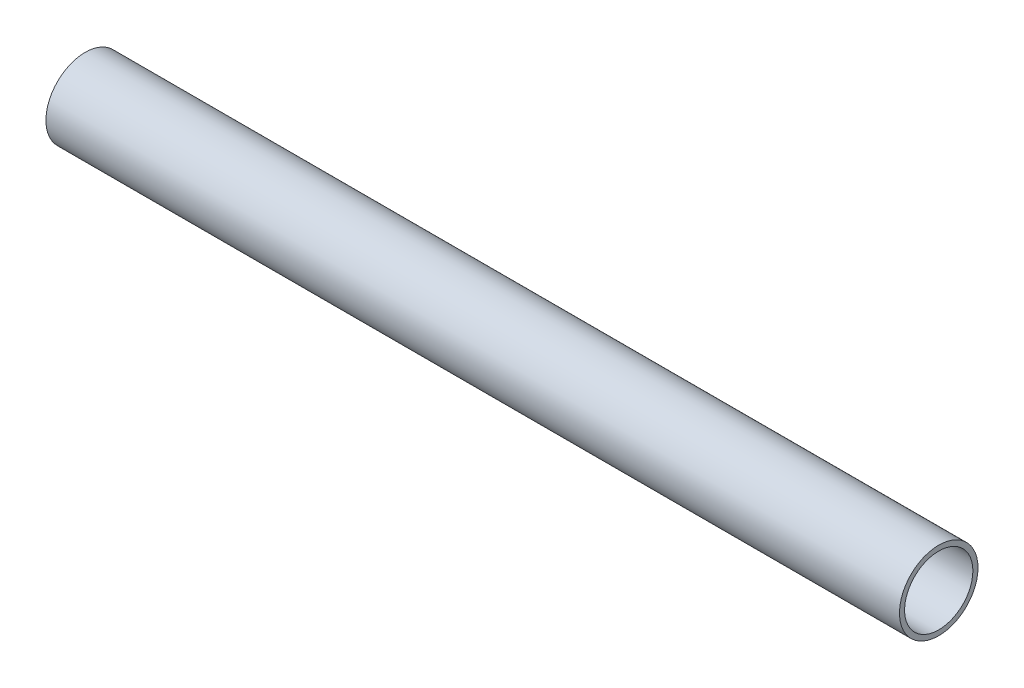
ISO-10303-21;
HEADER;
FILE_DESCRIPTION(('STEP AP214'),'2;1');
FILE_NAME('part.step','',(''),(''),'','','');
FILE_SCHEMA(('AUTOMOTIVE_DESIGN { 1 0 10303 214 1 1 1 1 }'));
ENDSEC;
DATA;
#1=APPLICATION_CONTEXT('core data for automotive mechanical design processes');
#2=APPLICATION_PROTOCOL_DEFINITION('international standard','automotive_design',2000,#1);
#3=PRODUCT_CONTEXT('',#1,'mechanical');
#4=PRODUCT('Part','Part','',(#3));
#5=PRODUCT_RELATED_PRODUCT_CATEGORY('part','',(#4));
#6=PRODUCT_DEFINITION_FORMATION('','',#4);
#7=PRODUCT_DEFINITION_CONTEXT('part definition',#1,'design');
#8=PRODUCT_DEFINITION('design','',#6,#7);
#9=PRODUCT_DEFINITION_SHAPE('','',#8);
#10=(LENGTH_UNIT() NAMED_UNIT(*) SI_UNIT(.MILLI.,.METRE.));
#11=(NAMED_UNIT(*) PLANE_ANGLE_UNIT() SI_UNIT($,.RADIAN.));
#12=(NAMED_UNIT(*) SI_UNIT($,.STERADIAN.) SOLID_ANGLE_UNIT());
#13=UNCERTAINTY_MEASURE_WITH_UNIT(LENGTH_MEASURE(1.E-05),#10,'distance_accuracy_value','');
#14=(GEOMETRIC_REPRESENTATION_CONTEXT(3) GLOBAL_UNCERTAINTY_ASSIGNED_CONTEXT((#13)) GLOBAL_UNIT_ASSIGNED_CONTEXT((#10,
#11,#12)) REPRESENTATION_CONTEXT('',''));
#15=CARTESIAN_POINT('',(0.,0.,0.));
#16=DIRECTION('',(0.,0.,1.));
#17=DIRECTION('',(1.,0.,0.));
#18=AXIS2_PLACEMENT_3D('',#15,#16,#17);
#19=CARTESIAN_POINT('',(250.,0.,0.));
#20=DIRECTION('',(1.,0.,0.));
#21=DIRECTION('',(0.,0.,-1.));
#22=AXIS2_PLACEMENT_3D('',#19,#20,#21);
#23=PLANE('',#22);
#24=CARTESIAN_POINT('',(250.,0.,0.));
#25=DIRECTION('',(1.,0.,0.));
#26=DIRECTION('',(0.,0.,-1.));
#27=AXIS2_PLACEMENT_3D('',#24,#25,#26);
#28=CIRCLE('',#27,11.5);
#29=CARTESIAN_POINT('',(250.,0.,-11.5));
#30=VERTEX_POINT('',#29);
#31=EDGE_CURVE('E10',#30,#30,#28,.T.);
#32=ORIENTED_EDGE('',*,*,#31,.T.);
#33=EDGE_LOOP('',(#32));
#34=FACE_BOUND('',#33,.T.);
#35=CARTESIAN_POINT('',(250.,0.,0.));
#36=DIRECTION('',(1.,0.,0.));
#37=DIRECTION('',(0.,0.,-1.));
#38=AXIS2_PLACEMENT_3D('',#35,#36,#37);
#39=CIRCLE('',#38,10.);
#40=CARTESIAN_POINT('',(250.,0.,-10.));
#41=VERTEX_POINT('',#40);
#42=EDGE_CURVE('E50',#41,#41,#39,.T.);
#43=ORIENTED_EDGE('',*,*,#42,.F.);
#44=EDGE_LOOP('',(#43));
#45=FACE_BOUND('',#44,.T.);
#46=ADVANCED_FACE('F39',(#34,#45),#23,.T.);
#47=CARTESIAN_POINT('',(0.,0.,0.));
#48=DIRECTION('',(1.,0.,0.));
#49=DIRECTION('',(0.,0.,-1.));
#50=AXIS2_PLACEMENT_3D('',#47,#48,#49);
#51=PLANE('',#50);
#52=CARTESIAN_POINT('',(0.,0.,0.));
#53=DIRECTION('',(1.,0.,0.));
#54=DIRECTION('',(0.,0.,-1.));
#55=AXIS2_PLACEMENT_3D('',#52,#53,#54);
#56=CIRCLE('',#55,11.5);
#57=CARTESIAN_POINT('',(0.,0.,-11.5));
#58=VERTEX_POINT('',#57);
#59=EDGE_CURVE('E43',#58,#58,#56,.T.);
#60=ORIENTED_EDGE('',*,*,#59,.F.);
#61=EDGE_LOOP('',(#60));
#62=FACE_BOUND('',#61,.T.);
#63=CARTESIAN_POINT('',(0.,0.,0.));
#64=DIRECTION('',(1.,0.,0.));
#65=DIRECTION('',(0.,0.,-1.));
#66=AXIS2_PLACEMENT_3D('',#63,#64,#65);
#67=CIRCLE('',#66,10.);
#68=CARTESIAN_POINT('',(0.,0.,-10.));
#69=VERTEX_POINT('',#68);
#70=EDGE_CURVE('E52',#69,#69,#67,.T.);
#71=ORIENTED_EDGE('',*,*,#70,.T.);
#72=EDGE_LOOP('',(#71));
#73=FACE_BOUND('',#72,.T.);
#74=ADVANCED_FACE('F62',(#62,#73),#51,.F.);
#75=CARTESIAN_POINT('',(250.,0.,0.));
#76=DIRECTION('',(-1.,0.,0.));
#77=DIRECTION('',(0.,0.,1.));
#78=AXIS2_PLACEMENT_3D('',#75,#76,#77);
#79=CYLINDRICAL_SURFACE('',#78,11.5);
#80=ORIENTED_EDGE('',*,*,#31,.F.);
#81=EDGE_LOOP('',(#80));
#82=FACE_BOUND('',#81,.T.);
#83=ORIENTED_EDGE('',*,*,#59,.T.);
#84=EDGE_LOOP('',(#83));
#85=FACE_BOUND('',#84,.T.);
#86=ADVANCED_FACE('F41',(#82,#85),#79,.T.);
#87=CARTESIAN_POINT('',(250.,0.,0.));
#88=DIRECTION('',(-1.,0.,0.));
#89=DIRECTION('',(0.,0.,1.));
#90=AXIS2_PLACEMENT_3D('',#87,#88,#89);
#91=CYLINDRICAL_SURFACE('',#90,10.);
#92=ORIENTED_EDGE('',*,*,#42,.T.);
#93=EDGE_LOOP('',(#92));
#94=FACE_BOUND('',#93,.T.);
#95=ORIENTED_EDGE('',*,*,#70,.F.);
#96=EDGE_LOOP('',(#95));
#97=FACE_BOUND('',#96,.T.);
#98=ADVANCED_FACE('F58',(#94,#97),#91,.F.);
#99=CLOSED_SHELL('',(#46,#74,#86,#98));
#100=MANIFOLD_SOLID_BREP('B2',#99);
#101=ADVANCED_BREP_SHAPE_REPRESENTATION('',(#18,#100),#14);
#102=SHAPE_DEFINITION_REPRESENTATION(#9,#101);
ENDSEC;
END-ISO-10303-21;
